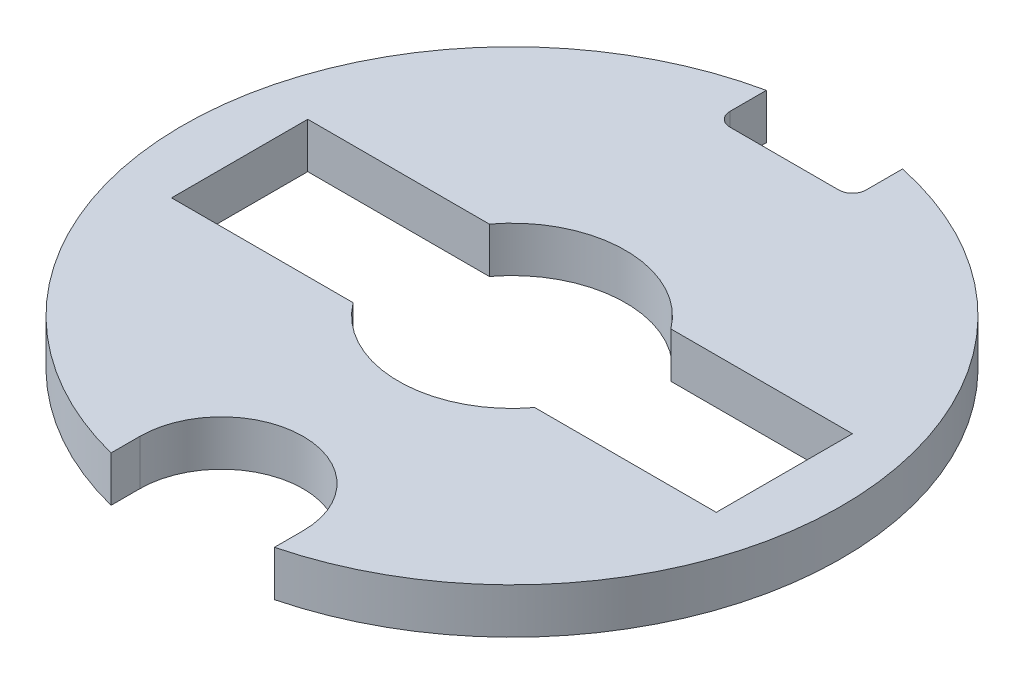
ISO-10303-21;
HEADER;
FILE_DESCRIPTION(('STEP AP214'),'2;1');
FILE_NAME('part.step','',(''),(''),'','','');
FILE_SCHEMA(('AUTOMOTIVE_DESIGN { 1 0 10303 214 1 1 1 1 }'));
ENDSEC;
DATA;
#1=APPLICATION_CONTEXT('core data for automotive mechanical design processes');
#2=APPLICATION_PROTOCOL_DEFINITION('international standard','automotive_design',2000,#1);
#3=PRODUCT_CONTEXT('',#1,'mechanical');
#4=PRODUCT('Part','Part','',(#3));
#5=PRODUCT_RELATED_PRODUCT_CATEGORY('part','',(#4));
#6=PRODUCT_DEFINITION_FORMATION('','',#4);
#7=PRODUCT_DEFINITION_CONTEXT('part definition',#1,'design');
#8=PRODUCT_DEFINITION('design','',#6,#7);
#9=PRODUCT_DEFINITION_SHAPE('','',#8);
#10=(LENGTH_UNIT() NAMED_UNIT(*) SI_UNIT(.MILLI.,.METRE.));
#11=(NAMED_UNIT(*) PLANE_ANGLE_UNIT() SI_UNIT($,.RADIAN.));
#12=(NAMED_UNIT(*) SI_UNIT($,.STERADIAN.) SOLID_ANGLE_UNIT());
#13=UNCERTAINTY_MEASURE_WITH_UNIT(LENGTH_MEASURE(1.E-05),#10,'distance_accuracy_value','');
#14=(GEOMETRIC_REPRESENTATION_CONTEXT(3) GLOBAL_UNCERTAINTY_ASSIGNED_CONTEXT((#13)) GLOBAL_UNIT_ASSIGNED_CONTEXT((#10,
#11,#12)) REPRESENTATION_CONTEXT('',''));
#15=CARTESIAN_POINT('',(0.,0.,0.));
#16=DIRECTION('',(0.,0.,1.));
#17=DIRECTION('',(1.,0.,0.));
#18=AXIS2_PLACEMENT_3D('',#15,#16,#17);
#19=CARTESIAN_POINT('',(0.,1.,0.));
#20=DIRECTION('',(0.,-1.,0.));
#21=DIRECTION('',(0.,0.,-1.));
#22=AXIS2_PLACEMENT_3D('',#19,#20,#21);
#23=CYLINDRICAL_SURFACE('',#22,7.26);
#24=CARTESIAN_POINT('',(0.,0.,0.));
#25=DIRECTION('',(0.,1.,0.));
#26=DIRECTION('',(0.,0.,1.));
#27=AXIS2_PLACEMENT_3D('',#24,#25,#26);
#28=CIRCLE('',#27,7.26);
#29=CARTESIAN_POINT('',(-1.5,0.,-7.1033513217354));
#30=VERTEX_POINT('',#29);
#31=CARTESIAN_POINT('',(-1.8,0.,7.03332069509133));
#32=VERTEX_POINT('',#31);
#33=EDGE_CURVE('E185',#30,#32,#28,.T.);
#34=ORIENTED_EDGE('',*,*,#33,.T.);
#35=DIRECTION('',(0.,1.,0.));
#36=VECTOR('',#35,1.);
#37=CARTESIAN_POINT('',(-1.8,0.,7.03332069509133));
#38=LINE('',#37,#36);
#39=CARTESIAN_POINT('',(-1.8,1.,7.03332069509133));
#40=VERTEX_POINT('',#39);
#41=EDGE_CURVE('E277',#32,#40,#38,.T.);
#42=ORIENTED_EDGE('',*,*,#41,.T.);
#43=CARTESIAN_POINT('',(0.,1.,0.));
#44=DIRECTION('',(0.,1.,0.));
#45=DIRECTION('',(0.,0.,1.));
#46=AXIS2_PLACEMENT_3D('',#43,#44,#45);
#47=CIRCLE('',#46,7.26);
#48=CARTESIAN_POINT('',(-1.5,1.,-7.1033513217354));
#49=VERTEX_POINT('',#48);
#50=EDGE_CURVE('E193',#49,#40,#47,.T.);
#51=ORIENTED_EDGE('',*,*,#50,.F.);
#52=DIRECTION('',(0.,1.,0.));
#53=VECTOR('',#52,1.);
#54=CARTESIAN_POINT('',(-1.5,0.,-7.1033513217354));
#55=LINE('',#54,#53);
#56=EDGE_CURVE('E186',#30,#49,#55,.T.);
#57=ORIENTED_EDGE('',*,*,#56,.F.);
#58=EDGE_LOOP('',(#34,#42,#51,#57));
#59=FACE_BOUND('',#58,.T.);
#60=ADVANCED_FACE('F34',(#59),#23,.T.);
#61=CARTESIAN_POINT('',(1.8,1.,7.03332069509133));
#62=VERTEX_POINT('',#61);
#63=CARTESIAN_POINT('',(1.5,1.,-7.1033513217354));
#64=VERTEX_POINT('',#63);
#65=EDGE_CURVE('E179',#62,#64,#47,.T.);
#66=ORIENTED_EDGE('',*,*,#65,.F.);
#67=DIRECTION('',(0.,1.,0.));
#68=VECTOR('',#67,1.);
#69=CARTESIAN_POINT('',(1.8,0.,7.03332069509133));
#70=LINE('',#69,#68);
#71=CARTESIAN_POINT('',(1.8,0.,7.03332069509133));
#72=VERTEX_POINT('',#71);
#73=EDGE_CURVE('E162',#72,#62,#70,.T.);
#74=ORIENTED_EDGE('',*,*,#73,.F.);
#75=CARTESIAN_POINT('',(1.5,0.,-7.1033513217354));
#76=VERTEX_POINT('',#75);
#77=EDGE_CURVE('E176',#72,#76,#28,.T.);
#78=ORIENTED_EDGE('',*,*,#77,.T.);
#79=DIRECTION('',(0.,1.,0.));
#80=VECTOR('',#79,1.);
#81=CARTESIAN_POINT('',(1.5,0.,-7.1033513217354));
#82=LINE('',#81,#80);
#83=EDGE_CURVE('E189',#76,#64,#82,.T.);
#84=ORIENTED_EDGE('',*,*,#83,.T.);
#85=EDGE_LOOP('',(#66,#74,#78,#84));
#86=FACE_BOUND('',#85,.T.);
#87=ADVANCED_FACE('F174',(#86),#23,.T.);
#88=CARTESIAN_POINT('',(0.,1.,0.));
#89=DIRECTION('',(0.,1.,0.));
#90=DIRECTION('',(0.,0.,1.));
#91=AXIS2_PLACEMENT_3D('',#88,#89,#90);
#92=PLANE('',#91);
#93=DIRECTION('',(0.,0.,1.));
#94=VECTOR('',#93,1.);
#95=CARTESIAN_POINT('',(-1.8,1.,6.4));
#96=LINE('',#95,#94);
#97=CARTESIAN_POINT('',(-1.8,1.,6.4));
#98=VERTEX_POINT('',#97);
#99=EDGE_CURVE('E169',#98,#40,#96,.T.);
#100=ORIENTED_EDGE('',*,*,#99,.F.);
#101=CARTESIAN_POINT('',(0.,1.,6.4));
#102=DIRECTION('',(0.,1.,0.));
#103=DIRECTION('',(0.,0.,1.));
#104=AXIS2_PLACEMENT_3D('',#101,#102,#103);
#105=CIRCLE('',#104,1.8);
#106=CARTESIAN_POINT('',(1.8,1.,6.4));
#107=VERTEX_POINT('',#106);
#108=EDGE_CURVE('E505',#107,#98,#105,.T.);
#109=ORIENTED_EDGE('',*,*,#108,.F.);
#110=DIRECTION('',(0.,0.,-1.));
#111=VECTOR('',#110,1.);
#112=CARTESIAN_POINT('',(1.8,1.,6.4));
#113=LINE('',#112,#111);
#114=EDGE_CURVE('E511',#62,#107,#113,.T.);
#115=ORIENTED_EDGE('',*,*,#114,.F.);
#116=ORIENTED_EDGE('',*,*,#65,.T.);
#117=DIRECTION('',(0.,0.,-1.));
#118=VECTOR('',#117,1.);
#119=CARTESIAN_POINT('',(1.5,1.,-7.1033513217354));
#120=LINE('',#119,#118);
#121=CARTESIAN_POINT('',(1.5,1.,-6.3));
#122=VERTEX_POINT('',#121);
#123=EDGE_CURVE('E225',#122,#64,#120,.T.);
#124=ORIENTED_EDGE('',*,*,#123,.F.);
#125=CARTESIAN_POINT('',(1.2,1.,-6.3));
#126=DIRECTION('',(0.,1.,0.));
#127=DIRECTION('',(0.,0.,1.));
#128=AXIS2_PLACEMENT_3D('',#125,#126,#127);
#129=CIRCLE('',#128,0.3);
#130=CARTESIAN_POINT('',(1.2,1.,-6.));
#131=VERTEX_POINT('',#130);
#132=EDGE_CURVE('E204',#122,#131,#129,.F.);
#133=ORIENTED_EDGE('',*,*,#132,.T.);
#134=DIRECTION('',(1.,0.,0.));
#135=VECTOR('',#134,1.);
#136=CARTESIAN_POINT('',(-1.5,1.,-6.));
#137=LINE('',#136,#135);
#138=CARTESIAN_POINT('',(-1.2,1.,-6.));
#139=VERTEX_POINT('',#138);
#140=EDGE_CURVE('E218',#139,#131,#137,.T.);
#141=ORIENTED_EDGE('',*,*,#140,.F.);
#142=CARTESIAN_POINT('',(-1.2,1.,-6.3));
#143=DIRECTION('',(0.,1.,0.));
#144=DIRECTION('',(0.,0.,1.));
#145=AXIS2_PLACEMENT_3D('',#142,#143,#144);
#146=CIRCLE('',#145,0.3);
#147=CARTESIAN_POINT('',(-1.5,1.,-6.3));
#148=VERTEX_POINT('',#147);
#149=EDGE_CURVE('E42',#139,#148,#146,.F.);
#150=ORIENTED_EDGE('',*,*,#149,.T.);
#151=DIRECTION('',(0.,0.,1.));
#152=VECTOR('',#151,1.);
#153=CARTESIAN_POINT('',(-1.5,1.,-7.1033513217354));
#154=LINE('',#153,#152);
#155=EDGE_CURVE('E229',#49,#148,#154,.T.);
#156=ORIENTED_EDGE('',*,*,#155,.F.);
#157=ORIENTED_EDGE('',*,*,#50,.T.);
#158=EDGE_LOOP('',(#100,#109,#115,#116,#124,#133,#141,#150,#156,#157));
#159=FACE_BOUND('',#158,.T.);
#160=DIRECTION('',(0.,0.,-1.));
#161=VECTOR('',#160,1.);
#162=CARTESIAN_POINT('',(6.,1.,1.5));
#163=LINE('',#162,#161);
#164=CARTESIAN_POINT('',(6.,1.,1.5));
#165=VERTEX_POINT('',#164);
#166=CARTESIAN_POINT('',(6.,1.,-1.5));
#167=VERTEX_POINT('',#166);
#168=EDGE_CURVE('E274',#165,#167,#163,.T.);
#169=ORIENTED_EDGE('',*,*,#168,.F.);
#170=DIRECTION('',(1.,0.,0.));
#171=VECTOR('',#170,1.);
#172=CARTESIAN_POINT('',(2.,1.,1.5));
#173=LINE('',#172,#171);
#174=CARTESIAN_POINT('',(2.,1.,1.5));
#175=VERTEX_POINT('',#174);
#176=EDGE_CURVE('E244',#175,#165,#173,.T.);
#177=ORIENTED_EDGE('',*,*,#176,.F.);
#178=CARTESIAN_POINT('',(0.,1.,0.));
#179=DIRECTION('',(0.,1.,0.));
#180=DIRECTION('',(0.,0.,1.));
#181=AXIS2_PLACEMENT_3D('',#178,#179,#180);
#182=CIRCLE('',#181,2.5);
#183=CARTESIAN_POINT('',(-2.,1.,1.5));
#184=VERTEX_POINT('',#183);
#185=EDGE_CURVE('E290',#184,#175,#182,.T.);
#186=ORIENTED_EDGE('',*,*,#185,.F.);
#187=DIRECTION('',(1.,0.,0.));
#188=VECTOR('',#187,1.);
#189=CARTESIAN_POINT('',(-6.,1.,1.5));
#190=LINE('',#189,#188);
#191=CARTESIAN_POINT('',(-6.,1.,1.5));
#192=VERTEX_POINT('',#191);
#193=EDGE_CURVE('E288',#192,#184,#190,.T.);
#194=ORIENTED_EDGE('',*,*,#193,.F.);
#195=DIRECTION('',(0.,0.,1.));
#196=VECTOR('',#195,1.);
#197=CARTESIAN_POINT('',(-6.,1.,1.5));
#198=LINE('',#197,#196);
#199=CARTESIAN_POINT('',(-6.,1.,-1.5));
#200=VERTEX_POINT('',#199);
#201=EDGE_CURVE('E285',#200,#192,#198,.T.);
#202=ORIENTED_EDGE('',*,*,#201,.F.);
#203=DIRECTION('',(-1.,0.,0.));
#204=VECTOR('',#203,1.);
#205=CARTESIAN_POINT('',(-6.,1.,-1.5));
#206=LINE('',#205,#204);
#207=CARTESIAN_POINT('',(-2.,1.,-1.5));
#208=VERTEX_POINT('',#207);
#209=EDGE_CURVE('E282',#208,#200,#206,.T.);
#210=ORIENTED_EDGE('',*,*,#209,.F.);
#211=CARTESIAN_POINT('',(0.,1.,0.));
#212=DIRECTION('',(0.,1.,0.));
#213=DIRECTION('',(0.,0.,1.));
#214=AXIS2_PLACEMENT_3D('',#211,#212,#213);
#215=CIRCLE('',#214,2.5);
#216=CARTESIAN_POINT('',(2.,1.,-1.5));
#217=VERTEX_POINT('',#216);
#218=EDGE_CURVE('E279',#217,#208,#215,.T.);
#219=ORIENTED_EDGE('',*,*,#218,.F.);
#220=DIRECTION('',(-1.,0.,0.));
#221=VECTOR('',#220,1.);
#222=CARTESIAN_POINT('',(2.,1.,-1.5));
#223=LINE('',#222,#221);
#224=EDGE_CURVE('E276',#167,#217,#223,.T.);
#225=ORIENTED_EDGE('',*,*,#224,.F.);
#226=EDGE_LOOP('',(#169,#177,#186,#194,#202,#210,#219,#225));
#227=FACE_BOUND('',#226,.T.);
#228=ADVANCED_FACE('F223',(#159,#227),#92,.T.);
#229=CARTESIAN_POINT('',(0.,0.,0.));
#230=DIRECTION('',(0.,1.,0.));
#231=DIRECTION('',(0.,0.,1.));
#232=AXIS2_PLACEMENT_3D('',#229,#230,#231);
#233=PLANE('',#232);
#234=DIRECTION('',(1.,0.,0.));
#235=VECTOR('',#234,1.);
#236=CARTESIAN_POINT('',(2.,0.,1.5));
#237=LINE('',#236,#235);
#238=CARTESIAN_POINT('',(2.,0.,1.5));
#239=VERTEX_POINT('',#238);
#240=CARTESIAN_POINT('',(6.,0.,1.5));
#241=VERTEX_POINT('',#240);
#242=EDGE_CURVE('E258',#239,#241,#237,.T.);
#243=ORIENTED_EDGE('',*,*,#242,.T.);
#244=DIRECTION('',(0.,0.,-1.));
#245=VECTOR('',#244,1.);
#246=CARTESIAN_POINT('',(6.,0.,1.5));
#247=LINE('',#246,#245);
#248=CARTESIAN_POINT('',(6.,0.,-1.5));
#249=VERTEX_POINT('',#248);
#250=EDGE_CURVE('E295',#241,#249,#247,.T.);
#251=ORIENTED_EDGE('',*,*,#250,.T.);
#252=DIRECTION('',(-1.,0.,0.));
#253=VECTOR('',#252,1.);
#254=CARTESIAN_POINT('',(2.,0.,-1.5));
#255=LINE('',#254,#253);
#256=CARTESIAN_POINT('',(2.,0.,-1.5));
#257=VERTEX_POINT('',#256);
#258=EDGE_CURVE('E298',#249,#257,#255,.T.);
#259=ORIENTED_EDGE('',*,*,#258,.T.);
#260=CARTESIAN_POINT('',(0.,0.,0.));
#261=DIRECTION('',(0.,1.,0.));
#262=DIRECTION('',(0.,0.,1.));
#263=AXIS2_PLACEMENT_3D('',#260,#261,#262);
#264=CIRCLE('',#263,2.5);
#265=CARTESIAN_POINT('',(-2.,0.,-1.5));
#266=VERTEX_POINT('',#265);
#267=EDGE_CURVE('E301',#257,#266,#264,.T.);
#268=ORIENTED_EDGE('',*,*,#267,.T.);
#269=DIRECTION('',(-1.,0.,0.));
#270=VECTOR('',#269,1.);
#271=CARTESIAN_POINT('',(-6.,0.,-1.5));
#272=LINE('',#271,#270);
#273=CARTESIAN_POINT('',(-6.,0.,-1.5));
#274=VERTEX_POINT('',#273);
#275=EDGE_CURVE('E307',#266,#274,#272,.T.);
#276=ORIENTED_EDGE('',*,*,#275,.T.);
#277=DIRECTION('',(0.,0.,1.));
#278=VECTOR('',#277,1.);
#279=CARTESIAN_POINT('',(-6.,0.,1.5));
#280=LINE('',#279,#278);
#281=CARTESIAN_POINT('',(-6.,0.,1.5));
#282=VERTEX_POINT('',#281);
#283=EDGE_CURVE('E310',#274,#282,#280,.T.);
#284=ORIENTED_EDGE('',*,*,#283,.T.);
#285=DIRECTION('',(1.,0.,0.));
#286=VECTOR('',#285,1.);
#287=CARTESIAN_POINT('',(-6.,0.,1.5));
#288=LINE('',#287,#286);
#289=CARTESIAN_POINT('',(-2.,0.,1.5));
#290=VERTEX_POINT('',#289);
#291=EDGE_CURVE('E270',#282,#290,#288,.T.);
#292=ORIENTED_EDGE('',*,*,#291,.T.);
#293=CARTESIAN_POINT('',(0.,0.,0.));
#294=DIRECTION('',(0.,1.,0.));
#295=DIRECTION('',(0.,0.,1.));
#296=AXIS2_PLACEMENT_3D('',#293,#294,#295);
#297=CIRCLE('',#296,2.5);
#298=EDGE_CURVE('E264',#290,#239,#297,.T.);
#299=ORIENTED_EDGE('',*,*,#298,.T.);
#300=EDGE_LOOP('',(#243,#251,#259,#268,#276,#284,#292,#299));
#301=FACE_BOUND('',#300,.T.);
#302=CARTESIAN_POINT('',(0.,0.,6.4));
#303=DIRECTION('',(0.,1.,0.));
#304=DIRECTION('',(0.,0.,1.));
#305=AXIS2_PLACEMENT_3D('',#302,#303,#304);
#306=CIRCLE('',#305,1.8);
#307=CARTESIAN_POINT('',(1.8,0.,6.4));
#308=VERTEX_POINT('',#307);
#309=CARTESIAN_POINT('',(-1.8,0.,6.4));
#310=VERTEX_POINT('',#309);
#311=EDGE_CURVE('E168',#308,#310,#306,.T.);
#312=ORIENTED_EDGE('',*,*,#311,.T.);
#313=DIRECTION('',(0.,0.,1.));
#314=VECTOR('',#313,1.);
#315=CARTESIAN_POINT('',(-1.8,0.,6.4));
#316=LINE('',#315,#314);
#317=EDGE_CURVE('E180',#310,#32,#316,.T.);
#318=ORIENTED_EDGE('',*,*,#317,.T.);
#319=ORIENTED_EDGE('',*,*,#33,.F.);
#320=DIRECTION('',(0.,0.,1.));
#321=VECTOR('',#320,1.);
#322=CARTESIAN_POINT('',(-1.5,0.,-7.1033513217354));
#323=LINE('',#322,#321);
#324=CARTESIAN_POINT('',(-1.5,0.,-6.3));
#325=VERTEX_POINT('',#324);
#326=EDGE_CURVE('E217',#30,#325,#323,.T.);
#327=ORIENTED_EDGE('',*,*,#326,.T.);
#328=CARTESIAN_POINT('',(-1.2,0.,-6.3));
#329=DIRECTION('',(0.,1.,0.));
#330=DIRECTION('',(0.,0.,1.));
#331=AXIS2_PLACEMENT_3D('',#328,#329,#330);
#332=CIRCLE('',#331,0.3);
#333=CARTESIAN_POINT('',(-1.2,0.,-6.));
#334=VERTEX_POINT('',#333);
#335=EDGE_CURVE('E11',#325,#334,#332,.T.);
#336=ORIENTED_EDGE('',*,*,#335,.T.);
#337=DIRECTION('',(1.,0.,0.));
#338=VECTOR('',#337,1.);
#339=CARTESIAN_POINT('',(-1.5,0.,-6.));
#340=LINE('',#339,#338);
#341=CARTESIAN_POINT('',(1.2,0.,-6.));
#342=VERTEX_POINT('',#341);
#343=EDGE_CURVE('E210',#334,#342,#340,.T.);
#344=ORIENTED_EDGE('',*,*,#343,.T.);
#345=CARTESIAN_POINT('',(1.2,0.,-6.3));
#346=DIRECTION('',(0.,1.,0.));
#347=DIRECTION('',(0.,0.,1.));
#348=AXIS2_PLACEMENT_3D('',#345,#346,#347);
#349=CIRCLE('',#348,0.3);
#350=CARTESIAN_POINT('',(1.5,0.,-6.3));
#351=VERTEX_POINT('',#350);
#352=EDGE_CURVE('E206',#342,#351,#349,.T.);
#353=ORIENTED_EDGE('',*,*,#352,.T.);
#354=DIRECTION('',(0.,0.,-1.));
#355=VECTOR('',#354,1.);
#356=CARTESIAN_POINT('',(1.5,0.,-7.1033513217354));
#357=LINE('',#356,#355);
#358=EDGE_CURVE('E184',#351,#76,#357,.T.);
#359=ORIENTED_EDGE('',*,*,#358,.T.);
#360=ORIENTED_EDGE('',*,*,#77,.F.);
#361=DIRECTION('',(0.,0.,-1.));
#362=VECTOR('',#361,1.);
#363=CARTESIAN_POINT('',(1.8,0.,6.4));
#364=LINE('',#363,#362);
#365=EDGE_CURVE('E158',#72,#308,#364,.T.);
#366=ORIENTED_EDGE('',*,*,#365,.T.);
#367=EDGE_LOOP('',(#312,#318,#319,#327,#336,#344,#353,#359,#360,#366));
#368=FACE_BOUND('',#367,.T.);
#369=ADVANCED_FACE('F182',(#301,#368),#233,.F.);
#370=CARTESIAN_POINT('',(1.5,0.,-7.1033513217354));
#371=DIRECTION('',(1.,0.,0.));
#372=DIRECTION('',(0.,0.,-1.));
#373=AXIS2_PLACEMENT_3D('',#370,#371,#372);
#374=PLANE('',#373);
#375=ORIENTED_EDGE('',*,*,#358,.F.);
#376=DIRECTION('',(0.,1.,0.));
#377=VECTOR('',#376,1.);
#378=CARTESIAN_POINT('',(1.5,1.,-6.3));
#379=LINE('',#378,#377);
#380=EDGE_CURVE('E195',#351,#122,#379,.T.);
#381=ORIENTED_EDGE('',*,*,#380,.T.);
#382=ORIENTED_EDGE('',*,*,#123,.T.);
#383=ORIENTED_EDGE('',*,*,#83,.F.);
#384=EDGE_LOOP('',(#375,#381,#382,#383));
#385=FACE_BOUND('',#384,.T.);
#386=ADVANCED_FACE('F215',(#385),#374,.F.);
#387=CARTESIAN_POINT('',(-1.5,0.,-6.));
#388=DIRECTION('',(0.,0.,1.));
#389=DIRECTION('',(1.,0.,0.));
#390=AXIS2_PLACEMENT_3D('',#387,#388,#389);
#391=PLANE('',#390);
#392=ORIENTED_EDGE('',*,*,#140,.T.);
#393=DIRECTION('',(0.,1.,0.));
#394=VECTOR('',#393,1.);
#395=CARTESIAN_POINT('',(1.2,0.,-6.));
#396=LINE('',#395,#394);
#397=EDGE_CURVE('E201',#131,#342,#396,.F.);
#398=ORIENTED_EDGE('',*,*,#397,.T.);
#399=ORIENTED_EDGE('',*,*,#343,.F.);
#400=DIRECTION('',(0.,1.,0.));
#401=VECTOR('',#400,1.);
#402=CARTESIAN_POINT('',(-1.2,1.,-6.));
#403=LINE('',#402,#401);
#404=EDGE_CURVE('E198',#334,#139,#403,.T.);
#405=ORIENTED_EDGE('',*,*,#404,.T.);
#406=EDGE_LOOP('',(#392,#398,#399,#405));
#407=FACE_BOUND('',#406,.T.);
#408=ADVANCED_FACE('F227',(#407),#391,.F.);
#409=CARTESIAN_POINT('',(-1.5,0.,-7.1033513217354));
#410=DIRECTION('',(-1.,0.,0.));
#411=DIRECTION('',(0.,0.,1.));
#412=AXIS2_PLACEMENT_3D('',#409,#410,#411);
#413=PLANE('',#412);
#414=ORIENTED_EDGE('',*,*,#155,.T.);
#415=DIRECTION('',(0.,1.,0.));
#416=VECTOR('',#415,1.);
#417=CARTESIAN_POINT('',(-1.5,0.,-6.3));
#418=LINE('',#417,#416);
#419=EDGE_CURVE('E49',#148,#325,#418,.F.);
#420=ORIENTED_EDGE('',*,*,#419,.T.);
#421=ORIENTED_EDGE('',*,*,#326,.F.);
#422=ORIENTED_EDGE('',*,*,#56,.T.);
#423=EDGE_LOOP('',(#414,#420,#421,#422));
#424=FACE_BOUND('',#423,.T.);
#425=ADVANCED_FACE('F379',(#424),#413,.F.);
#426=CARTESIAN_POINT('',(6.,0.,1.5));
#427=DIRECTION('',(1.,0.,0.));
#428=DIRECTION('',(0.,0.,-1.));
#429=AXIS2_PLACEMENT_3D('',#426,#427,#428);
#430=PLANE('',#429);
#431=ORIENTED_EDGE('',*,*,#168,.T.);
#432=DIRECTION('',(0.,1.,0.));
#433=VECTOR('',#432,1.);
#434=CARTESIAN_POINT('',(6.,0.,-1.5));
#435=LINE('',#434,#433);
#436=EDGE_CURVE('E256',#249,#167,#435,.T.);
#437=ORIENTED_EDGE('',*,*,#436,.F.);
#438=ORIENTED_EDGE('',*,*,#250,.F.);
#439=DIRECTION('',(0.,1.,0.));
#440=VECTOR('',#439,1.);
#441=CARTESIAN_POINT('',(6.,0.,1.5));
#442=LINE('',#441,#440);
#443=EDGE_CURVE('E235',#241,#165,#442,.T.);
#444=ORIENTED_EDGE('',*,*,#443,.T.);
#445=EDGE_LOOP('',(#431,#437,#438,#444));
#446=FACE_BOUND('',#445,.T.);
#447=ADVANCED_FACE('F321',(#446),#430,.F.);
#448=CARTESIAN_POINT('',(2.,0.,1.5));
#449=DIRECTION('',(0.,0.,1.));
#450=DIRECTION('',(1.,0.,0.));
#451=AXIS2_PLACEMENT_3D('',#448,#449,#450);
#452=PLANE('',#451);
#453=ORIENTED_EDGE('',*,*,#176,.T.);
#454=ORIENTED_EDGE('',*,*,#443,.F.);
#455=ORIENTED_EDGE('',*,*,#242,.F.);
#456=DIRECTION('',(0.,1.,0.));
#457=VECTOR('',#456,1.);
#458=CARTESIAN_POINT('',(2.,0.,1.5));
#459=LINE('',#458,#457);
#460=EDGE_CURVE('E236',#239,#175,#459,.T.);
#461=ORIENTED_EDGE('',*,*,#460,.T.);
#462=EDGE_LOOP('',(#453,#454,#455,#461));
#463=FACE_BOUND('',#462,.T.);
#464=ADVANCED_FACE('F320',(#463),#452,.F.);
#465=CARTESIAN_POINT('',(0.,0.,0.));
#466=DIRECTION('',(0.,1.,0.));
#467=DIRECTION('',(0.,0.,1.));
#468=AXIS2_PLACEMENT_3D('',#465,#466,#467);
#469=CYLINDRICAL_SURFACE('',#468,2.5);
#470=ORIENTED_EDGE('',*,*,#185,.T.);
#471=ORIENTED_EDGE('',*,*,#460,.F.);
#472=ORIENTED_EDGE('',*,*,#298,.F.);
#473=DIRECTION('',(0.,1.,0.));
#474=VECTOR('',#473,1.);
#475=CARTESIAN_POINT('',(-2.,0.,1.5));
#476=LINE('',#475,#474);
#477=EDGE_CURVE('E241',#290,#184,#476,.T.);
#478=ORIENTED_EDGE('',*,*,#477,.T.);
#479=EDGE_LOOP('',(#470,#471,#472,#478));
#480=FACE_BOUND('',#479,.T.);
#481=ADVANCED_FACE('F319',(#480),#469,.F.);
#482=CARTESIAN_POINT('',(-6.,0.,1.5));
#483=DIRECTION('',(0.,0.,1.));
#484=DIRECTION('',(1.,0.,0.));
#485=AXIS2_PLACEMENT_3D('',#482,#483,#484);
#486=PLANE('',#485);
#487=ORIENTED_EDGE('',*,*,#193,.T.);
#488=ORIENTED_EDGE('',*,*,#477,.F.);
#489=ORIENTED_EDGE('',*,*,#291,.F.);
#490=DIRECTION('',(0.,1.,0.));
#491=VECTOR('',#490,1.);
#492=CARTESIAN_POINT('',(-6.,0.,1.5));
#493=LINE('',#492,#491);
#494=EDGE_CURVE('E248',#282,#192,#493,.T.);
#495=ORIENTED_EDGE('',*,*,#494,.T.);
#496=EDGE_LOOP('',(#487,#488,#489,#495));
#497=FACE_BOUND('',#496,.T.);
#498=ADVANCED_FACE('F317',(#497),#486,.F.);
#499=CARTESIAN_POINT('',(-6.,0.,1.5));
#500=DIRECTION('',(-1.,0.,0.));
#501=DIRECTION('',(0.,0.,1.));
#502=AXIS2_PLACEMENT_3D('',#499,#500,#501);
#503=PLANE('',#502);
#504=ORIENTED_EDGE('',*,*,#201,.T.);
#505=ORIENTED_EDGE('',*,*,#494,.F.);
#506=ORIENTED_EDGE('',*,*,#283,.F.);
#507=DIRECTION('',(0.,1.,0.));
#508=VECTOR('',#507,1.);
#509=CARTESIAN_POINT('',(-6.,0.,-1.5));
#510=LINE('',#509,#508);
#511=EDGE_CURVE('E250',#274,#200,#510,.T.);
#512=ORIENTED_EDGE('',*,*,#511,.T.);
#513=EDGE_LOOP('',(#504,#505,#506,#512));
#514=FACE_BOUND('',#513,.T.);
#515=ADVANCED_FACE('F333',(#514),#503,.F.);
#516=CARTESIAN_POINT('',(-6.,0.,-1.5));
#517=DIRECTION('',(0.,0.,-1.));
#518=DIRECTION('',(-1.,0.,0.));
#519=AXIS2_PLACEMENT_3D('',#516,#517,#518);
#520=PLANE('',#519);
#521=ORIENTED_EDGE('',*,*,#209,.T.);
#522=ORIENTED_EDGE('',*,*,#511,.F.);
#523=ORIENTED_EDGE('',*,*,#275,.F.);
#524=DIRECTION('',(0.,1.,0.));
#525=VECTOR('',#524,1.);
#526=CARTESIAN_POINT('',(-2.,0.,-1.5));
#527=LINE('',#526,#525);
#528=EDGE_CURVE('E252',#266,#208,#527,.T.);
#529=ORIENTED_EDGE('',*,*,#528,.T.);
#530=EDGE_LOOP('',(#521,#522,#523,#529));
#531=FACE_BOUND('',#530,.T.);
#532=ADVANCED_FACE('F330',(#531),#520,.F.);
#533=CARTESIAN_POINT('',(0.,0.,0.));
#534=DIRECTION('',(0.,1.,0.));
#535=DIRECTION('',(0.,0.,1.));
#536=AXIS2_PLACEMENT_3D('',#533,#534,#535);
#537=CYLINDRICAL_SURFACE('',#536,2.5);
#538=ORIENTED_EDGE('',*,*,#218,.T.);
#539=ORIENTED_EDGE('',*,*,#528,.F.);
#540=ORIENTED_EDGE('',*,*,#267,.F.);
#541=DIRECTION('',(0.,1.,0.));
#542=VECTOR('',#541,1.);
#543=CARTESIAN_POINT('',(2.,0.,-1.5));
#544=LINE('',#543,#542);
#545=EDGE_CURVE('E254',#257,#217,#544,.T.);
#546=ORIENTED_EDGE('',*,*,#545,.T.);
#547=EDGE_LOOP('',(#538,#539,#540,#546));
#548=FACE_BOUND('',#547,.T.);
#549=ADVANCED_FACE('F326',(#548),#537,.F.);
#550=CARTESIAN_POINT('',(2.,0.,-1.5));
#551=DIRECTION('',(0.,0.,-1.));
#552=DIRECTION('',(-1.,0.,0.));
#553=AXIS2_PLACEMENT_3D('',#550,#551,#552);
#554=PLANE('',#553);
#555=ORIENTED_EDGE('',*,*,#224,.T.);
#556=ORIENTED_EDGE('',*,*,#545,.F.);
#557=ORIENTED_EDGE('',*,*,#258,.F.);
#558=ORIENTED_EDGE('',*,*,#436,.T.);
#559=EDGE_LOOP('',(#555,#556,#557,#558));
#560=FACE_BOUND('',#559,.T.);
#561=ADVANCED_FACE('F323',(#560),#554,.F.);
#562=CARTESIAN_POINT('',(-1.8,0.,6.4));
#563=DIRECTION('',(-1.,0.,0.));
#564=DIRECTION('',(0.,0.,1.));
#565=AXIS2_PLACEMENT_3D('',#562,#563,#564);
#566=PLANE('',#565);
#567=ORIENTED_EDGE('',*,*,#99,.T.);
#568=ORIENTED_EDGE('',*,*,#41,.F.);
#569=ORIENTED_EDGE('',*,*,#317,.F.);
#570=DIRECTION('',(0.,1.,0.));
#571=VECTOR('',#570,1.);
#572=CARTESIAN_POINT('',(-1.8,0.,6.4));
#573=LINE('',#572,#571);
#574=EDGE_CURVE('E501',#310,#98,#573,.T.);
#575=ORIENTED_EDGE('',*,*,#574,.T.);
#576=EDGE_LOOP('',(#567,#568,#569,#575));
#577=FACE_BOUND('',#576,.T.);
#578=ADVANCED_FACE('F358',(#577),#566,.F.);
#579=CARTESIAN_POINT('',(0.,0.,6.4));
#580=DIRECTION('',(0.,1.,0.));
#581=DIRECTION('',(0.,0.,1.));
#582=AXIS2_PLACEMENT_3D('',#579,#580,#581);
#583=CYLINDRICAL_SURFACE('',#582,1.8);
#584=ORIENTED_EDGE('',*,*,#108,.T.);
#585=ORIENTED_EDGE('',*,*,#574,.F.);
#586=ORIENTED_EDGE('',*,*,#311,.F.);
#587=DIRECTION('',(0.,1.,0.));
#588=VECTOR('',#587,1.);
#589=CARTESIAN_POINT('',(1.8,0.,6.4));
#590=LINE('',#589,#588);
#591=EDGE_CURVE('E164',#308,#107,#590,.T.);
#592=ORIENTED_EDGE('',*,*,#591,.T.);
#593=EDGE_LOOP('',(#584,#585,#586,#592));
#594=FACE_BOUND('',#593,.T.);
#595=ADVANCED_FACE('F353',(#594),#583,.F.);
#596=CARTESIAN_POINT('',(1.8,0.,6.4));
#597=DIRECTION('',(1.,0.,0.));
#598=DIRECTION('',(0.,0.,-1.));
#599=AXIS2_PLACEMENT_3D('',#596,#597,#598);
#600=PLANE('',#599);
#601=ORIENTED_EDGE('',*,*,#114,.T.);
#602=ORIENTED_EDGE('',*,*,#591,.F.);
#603=ORIENTED_EDGE('',*,*,#365,.F.);
#604=ORIENTED_EDGE('',*,*,#73,.T.);
#605=EDGE_LOOP('',(#601,#602,#603,#604));
#606=FACE_BOUND('',#605,.T.);
#607=ADVANCED_FACE('F161',(#606),#600,.F.);
#608=CARTESIAN_POINT('',(1.2,0.,-6.3));
#609=DIRECTION('',(0.,-1.,0.));
#610=DIRECTION('',(0.,0.,-1.));
#611=AXIS2_PLACEMENT_3D('',#608,#609,#610);
#612=CYLINDRICAL_SURFACE('',#611,0.3);
#613=ORIENTED_EDGE('',*,*,#352,.F.);
#614=ORIENTED_EDGE('',*,*,#397,.F.);
#615=ORIENTED_EDGE('',*,*,#132,.F.);
#616=ORIENTED_EDGE('',*,*,#380,.F.);
#617=EDGE_LOOP('',(#613,#614,#615,#616));
#618=FACE_BOUND('',#617,.T.);
#619=ADVANCED_FACE('F220',(#618),#612,.F.);
#620=CARTESIAN_POINT('',(-1.2,0.,-6.3));
#621=DIRECTION('',(0.,-1.,0.));
#622=DIRECTION('',(0.,0.,-1.));
#623=AXIS2_PLACEMENT_3D('',#620,#621,#622);
#624=CYLINDRICAL_SURFACE('',#623,0.3);
#625=ORIENTED_EDGE('',*,*,#335,.F.);
#626=ORIENTED_EDGE('',*,*,#419,.F.);
#627=ORIENTED_EDGE('',*,*,#149,.F.);
#628=ORIENTED_EDGE('',*,*,#404,.F.);
#629=EDGE_LOOP('',(#625,#626,#627,#628));
#630=FACE_BOUND('',#629,.T.);
#631=ADVANCED_FACE('F36',(#630),#624,.F.);
#632=CLOSED_SHELL('',(#60,#87,#228,#369,#386,#408,#425,#447,#464,#481,#498,#515,#532,#549,#561,
#578,#595,#607,#619,#631));
#633=MANIFOLD_SOLID_BREP('B2',#632);
#634=ADVANCED_BREP_SHAPE_REPRESENTATION('',(#18,#633),#14);
#635=SHAPE_DEFINITION_REPRESENTATION(#9,#634);
ENDSEC;
END-ISO-10303-21;
